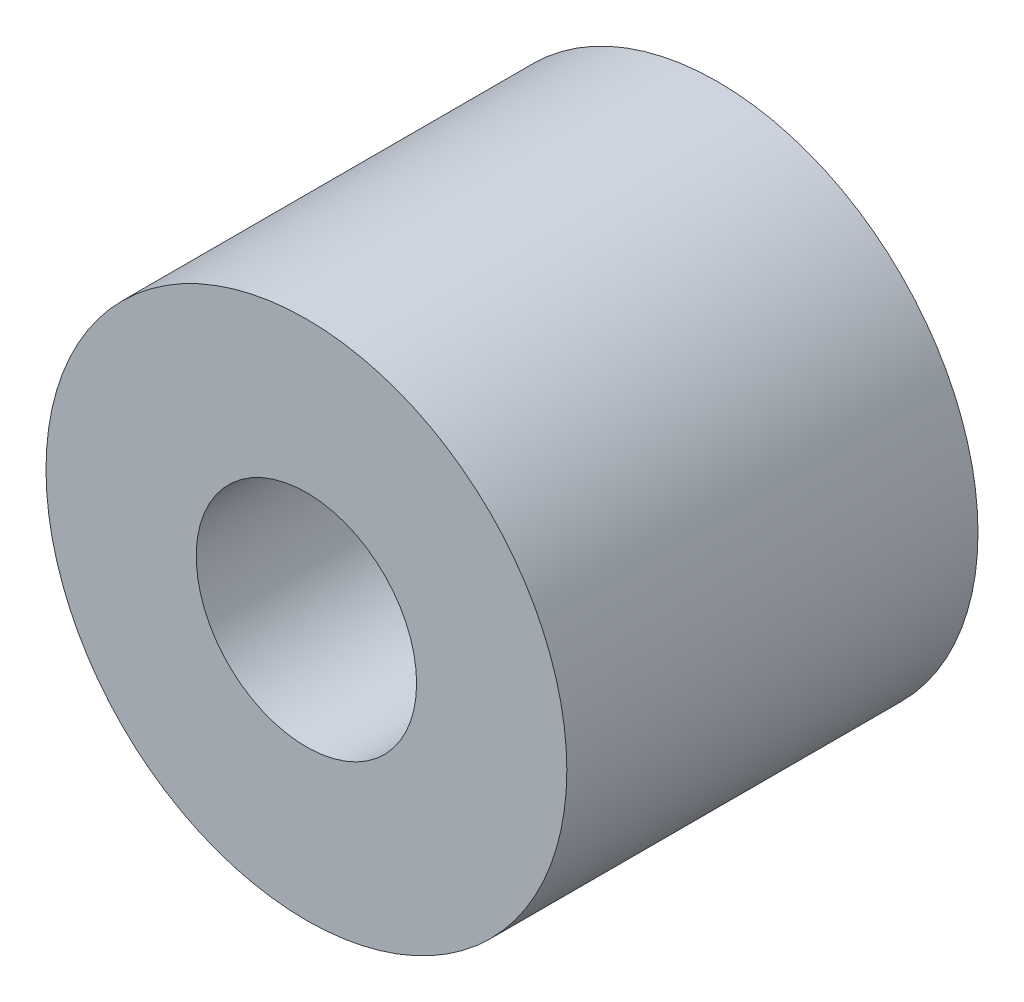
ISO-10303-21;
HEADER;
FILE_DESCRIPTION(('STEP AP214'),'2;1');
FILE_NAME('part.step','',(''),(''),'','','');
FILE_SCHEMA(('AUTOMOTIVE_DESIGN { 1 0 10303 214 1 1 1 1 }'));
ENDSEC;
DATA;
#1=APPLICATION_CONTEXT('core data for automotive mechanical design processes');
#2=APPLICATION_PROTOCOL_DEFINITION('international standard','automotive_design',2000,#1);
#3=PRODUCT_CONTEXT('',#1,'mechanical');
#4=PRODUCT('Part','Part','',(#3));
#5=PRODUCT_RELATED_PRODUCT_CATEGORY('part','',(#4));
#6=PRODUCT_DEFINITION_FORMATION('','',#4);
#7=PRODUCT_DEFINITION_CONTEXT('part definition',#1,'design');
#8=PRODUCT_DEFINITION('design','',#6,#7);
#9=PRODUCT_DEFINITION_SHAPE('','',#8);
#10=(LENGTH_UNIT() NAMED_UNIT(*) SI_UNIT(.MILLI.,.METRE.));
#11=(NAMED_UNIT(*) PLANE_ANGLE_UNIT() SI_UNIT($,.RADIAN.));
#12=(NAMED_UNIT(*) SI_UNIT($,.STERADIAN.) SOLID_ANGLE_UNIT());
#13=UNCERTAINTY_MEASURE_WITH_UNIT(LENGTH_MEASURE(1.E-05),#10,'distance_accuracy_value','');
#14=(GEOMETRIC_REPRESENTATION_CONTEXT(3) GLOBAL_UNCERTAINTY_ASSIGNED_CONTEXT((#13)) GLOBAL_UNIT_ASSIGNED_CONTEXT((#10,
#11,#12)) REPRESENTATION_CONTEXT('',''));
#15=CARTESIAN_POINT('',(0.,0.,0.));
#16=DIRECTION('',(0.,0.,1.));
#17=DIRECTION('',(1.,0.,0.));
#18=AXIS2_PLACEMENT_3D('',#15,#16,#17);
#19=CARTESIAN_POINT('',(0.,0.,4.7625));
#20=DIRECTION('',(0.,0.,-1.));
#21=DIRECTION('',(-1.,0.,0.));
#22=AXIS2_PLACEMENT_3D('',#19,#20,#21);
#23=CYLINDRICAL_SURFACE('',#22,6.0325);
#24=CARTESIAN_POINT('',(0.,0.,4.7625));
#25=DIRECTION('',(0.,0.,1.));
#26=DIRECTION('',(1.,0.,0.));
#27=AXIS2_PLACEMENT_3D('',#24,#25,#26);
#28=CIRCLE('',#27,6.0325);
#29=CARTESIAN_POINT('',(6.0325,0.,4.7625));
#30=VERTEX_POINT('',#29);
#31=EDGE_CURVE('E10',#30,#30,#28,.T.);
#32=ORIENTED_EDGE('',*,*,#31,.F.);
#33=EDGE_LOOP('',(#32));
#34=FACE_BOUND('',#33,.T.);
#35=CARTESIAN_POINT('',(0.,0.,-4.7625));
#36=DIRECTION('',(0.,0.,1.));
#37=DIRECTION('',(1.,0.,0.));
#38=AXIS2_PLACEMENT_3D('',#35,#36,#37);
#39=CIRCLE('',#38,6.0325);
#40=CARTESIAN_POINT('',(6.0325,0.,-4.7625));
#41=VERTEX_POINT('',#40);
#42=EDGE_CURVE('E44',#41,#41,#39,.T.);
#43=ORIENTED_EDGE('',*,*,#42,.T.);
#44=EDGE_LOOP('',(#43));
#45=FACE_BOUND('',#44,.T.);
#46=ADVANCED_FACE('F41',(#34,#45),#23,.T.);
#47=CARTESIAN_POINT('',(0.,0.,4.7625));
#48=DIRECTION('',(0.,0.,1.));
#49=DIRECTION('',(1.,0.,0.));
#50=AXIS2_PLACEMENT_3D('',#47,#48,#49);
#51=PLANE('',#50);
#52=CARTESIAN_POINT('',(0.,0.,4.7625));
#53=DIRECTION('',(0.,0.,1.));
#54=DIRECTION('',(1.,0.,0.));
#55=AXIS2_PLACEMENT_3D('',#52,#53,#54);
#56=CIRCLE('',#55,2.5527);
#57=CARTESIAN_POINT('',(2.5527,0.,4.7625));
#58=VERTEX_POINT('',#57);
#59=EDGE_CURVE('E55',#58,#58,#56,.T.);
#60=ORIENTED_EDGE('',*,*,#59,.F.);
#61=EDGE_LOOP('',(#60));
#62=FACE_BOUND('',#61,.T.);
#63=ORIENTED_EDGE('',*,*,#31,.T.);
#64=EDGE_LOOP('',(#63));
#65=FACE_BOUND('',#64,.T.);
#66=ADVANCED_FACE('F61',(#62,#65),#51,.T.);
#67=CARTESIAN_POINT('',(0.,0.,-4.7625));
#68=DIRECTION('',(0.,0.,1.));
#69=DIRECTION('',(1.,0.,0.));
#70=AXIS2_PLACEMENT_3D('',#67,#68,#69);
#71=PLANE('',#70);
#72=CARTESIAN_POINT('',(0.,0.,-4.7625));
#73=DIRECTION('',(0.,0.,1.));
#74=DIRECTION('',(1.,0.,0.));
#75=AXIS2_PLACEMENT_3D('',#72,#73,#74);
#76=CIRCLE('',#75,2.5527);
#77=CARTESIAN_POINT('',(2.5527,0.,-4.7625));
#78=VERTEX_POINT('',#77);
#79=EDGE_CURVE('E51',#78,#78,#76,.T.);
#80=ORIENTED_EDGE('',*,*,#79,.T.);
#81=EDGE_LOOP('',(#80));
#82=FACE_BOUND('',#81,.T.);
#83=ORIENTED_EDGE('',*,*,#42,.F.);
#84=EDGE_LOOP('',(#83));
#85=FACE_BOUND('',#84,.T.);
#86=ADVANCED_FACE('F63',(#82,#85),#71,.F.);
#87=CARTESIAN_POINT('',(0.,0.,4.7625));
#88=DIRECTION('',(0.,0.,1.));
#89=DIRECTION('',(1.,0.,0.));
#90=AXIS2_PLACEMENT_3D('',#87,#88,#89);
#91=CYLINDRICAL_SURFACE('',#90,2.5527);
#92=ORIENTED_EDGE('',*,*,#79,.F.);
#93=EDGE_LOOP('',(#92));
#94=FACE_BOUND('',#93,.T.);
#95=ORIENTED_EDGE('',*,*,#59,.T.);
#96=EDGE_LOOP('',(#95));
#97=FACE_BOUND('',#96,.T.);
#98=ADVANCED_FACE('F59',(#94,#97),#91,.F.);
#99=CLOSED_SHELL('',(#46,#66,#86,#98));
#100=MANIFOLD_SOLID_BREP('B2',#99);
#101=ADVANCED_BREP_SHAPE_REPRESENTATION('',(#18,#100),#14);
#102=SHAPE_DEFINITION_REPRESENTATION(#9,#101);
ENDSEC;
END-ISO-10303-21;
